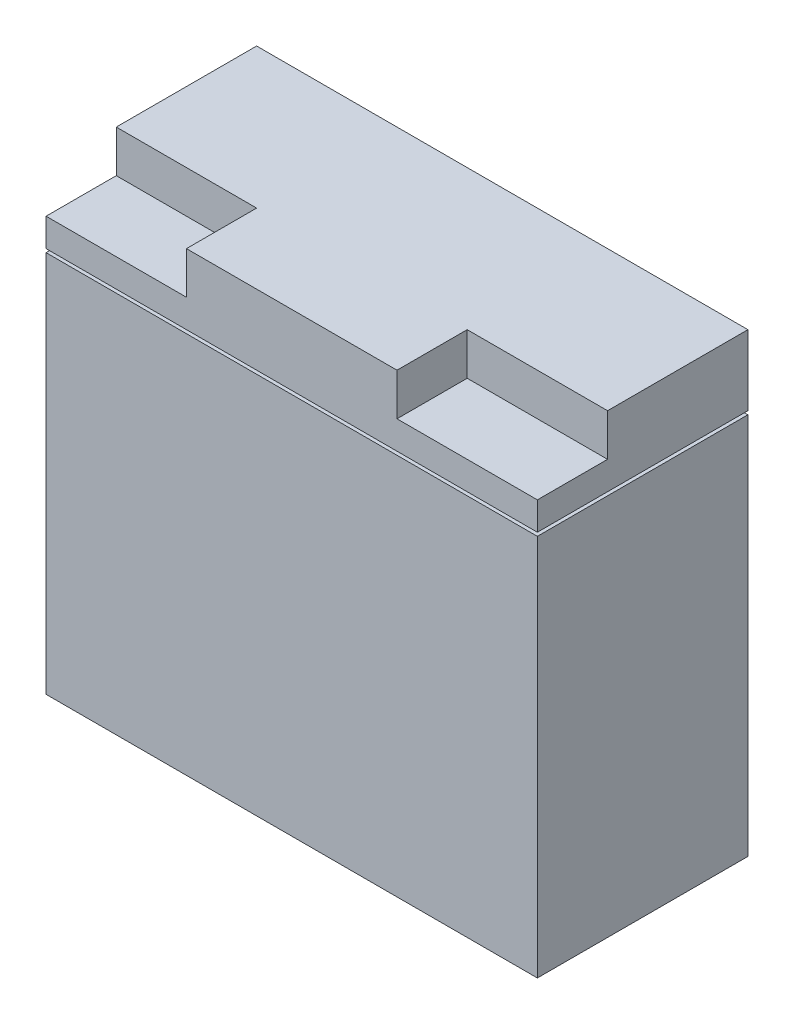
ISO-10303-21;
HEADER;
FILE_DESCRIPTION(('STEP AP214'),'2;1');
FILE_NAME('part.step','',(''),(''),'','','');
FILE_SCHEMA(('AUTOMOTIVE_DESIGN { 1 0 10303 214 1 1 1 1 }'));
ENDSEC;
DATA;
#1=APPLICATION_CONTEXT('core data for automotive mechanical design processes');
#2=APPLICATION_PROTOCOL_DEFINITION('international standard','automotive_design',2000,#1);
#3=PRODUCT_CONTEXT('',#1,'mechanical');
#4=PRODUCT('Part','Part','',(#3));
#5=PRODUCT_RELATED_PRODUCT_CATEGORY('part','',(#4));
#6=PRODUCT_DEFINITION_FORMATION('','',#4);
#7=PRODUCT_DEFINITION_CONTEXT('part definition',#1,'design');
#8=PRODUCT_DEFINITION('design','',#6,#7);
#9=PRODUCT_DEFINITION_SHAPE('','',#8);
#10=(LENGTH_UNIT() NAMED_UNIT(*) SI_UNIT(.MILLI.,.METRE.));
#11=(NAMED_UNIT(*) PLANE_ANGLE_UNIT() SI_UNIT($,.RADIAN.));
#12=(NAMED_UNIT(*) SI_UNIT($,.STERADIAN.) SOLID_ANGLE_UNIT());
#13=UNCERTAINTY_MEASURE_WITH_UNIT(LENGTH_MEASURE(1.E-05),#10,'distance_accuracy_value','');
#14=(GEOMETRIC_REPRESENTATION_CONTEXT(3) GLOBAL_UNCERTAINTY_ASSIGNED_CONTEXT((#13)) GLOBAL_UNIT_ASSIGNED_CONTEXT((#10,
#11,#12)) REPRESENTATION_CONTEXT('',''));
#15=CARTESIAN_POINT('',(0.,0.,0.));
#16=DIRECTION('',(0.,0.,1.));
#17=DIRECTION('',(1.,0.,0.));
#18=AXIS2_PLACEMENT_3D('',#15,#16,#17);
#19=CARTESIAN_POINT('',(0.,165.1,0.));
#20=DIRECTION('',(1.,0.,0.));
#21=DIRECTION('',(0.,0.,-1.));
#22=AXIS2_PLACEMENT_3D('',#19,#20,#21);
#23=PLANE('',#22);
#24=DIRECTION('',(0.,-1.,0.));
#25=VECTOR('',#24,1.);
#26=CARTESIAN_POINT('',(0.,165.1,-76.2));
#27=LINE('',#26,#25);
#28=CARTESIAN_POINT('',(0.,165.1,-76.2));
#29=VERTEX_POINT('',#28);
#30=CARTESIAN_POINT('',(0.,139.7,-76.2));
#31=VERTEX_POINT('',#30);
#32=EDGE_CURVE('E321',#29,#31,#27,.T.);
#33=ORIENTED_EDGE('',*,*,#32,.T.);
#34=DIRECTION('',(0.,0.,1.));
#35=VECTOR('',#34,1.);
#36=CARTESIAN_POINT('',(0.,139.7,-76.2));
#37=LINE('',#36,#35);
#38=CARTESIAN_POINT('',(0.,139.7,0.));
#39=VERTEX_POINT('',#38);
#40=EDGE_CURVE('E62',#31,#39,#37,.T.);
#41=ORIENTED_EDGE('',*,*,#40,.T.);
#42=DIRECTION('',(0.,-1.,0.));
#43=VECTOR('',#42,1.);
#44=CARTESIAN_POINT('',(0.,165.1,0.));
#45=LINE('',#44,#43);
#46=CARTESIAN_POINT('',(0.,149.86,0.));
#47=VERTEX_POINT('',#46);
#48=EDGE_CURVE('E11',#47,#39,#45,.T.);
#49=ORIENTED_EDGE('',*,*,#48,.F.);
#50=DIRECTION('',(0.,0.,1.));
#51=VECTOR('',#50,1.);
#52=CARTESIAN_POINT('',(0.,149.86,0.));
#53=LINE('',#52,#51);
#54=CARTESIAN_POINT('',(0.,149.86,-25.4));
#55=VERTEX_POINT('',#54);
#56=EDGE_CURVE('E268',#55,#47,#53,.T.);
#57=ORIENTED_EDGE('',*,*,#56,.F.);
#58=DIRECTION('',(0.,1.,0.));
#59=VECTOR('',#58,1.);
#60=CARTESIAN_POINT('',(0.,149.86,-25.4));
#61=LINE('',#60,#59);
#62=CARTESIAN_POINT('',(0.,165.1,-25.4));
#63=VERTEX_POINT('',#62);
#64=EDGE_CURVE('E287',#55,#63,#61,.T.);
#65=ORIENTED_EDGE('',*,*,#64,.T.);
#66=DIRECTION('',(0.,0.,1.));
#67=VECTOR('',#66,1.);
#68=CARTESIAN_POINT('',(0.,165.1,0.));
#69=LINE('',#68,#67);
#70=EDGE_CURVE('E296',#29,#63,#69,.T.);
#71=ORIENTED_EDGE('',*,*,#70,.F.);
#72=EDGE_LOOP('',(#33,#41,#49,#57,#65,#71));
#73=FACE_BOUND('',#72,.T.);
#74=ADVANCED_FACE('F40',(#73),#23,.F.);
#75=CARTESIAN_POINT('',(0.,165.1,0.));
#76=DIRECTION('',(0.,0.,-1.));
#77=DIRECTION('',(-1.,0.,0.));
#78=AXIS2_PLACEMENT_3D('',#75,#76,#77);
#79=PLANE('',#78);
#80=ORIENTED_EDGE('',*,*,#48,.T.);
#81=DIRECTION('',(1.,0.,0.));
#82=VECTOR('',#81,1.);
#83=CARTESIAN_POINT('',(0.,139.7,0.));
#84=LINE('',#83,#82);
#85=CARTESIAN_POINT('',(177.8,139.7,0.));
#86=VERTEX_POINT('',#85);
#87=EDGE_CURVE('E213',#39,#86,#84,.T.);
#88=ORIENTED_EDGE('',*,*,#87,.T.);
#89=DIRECTION('',(0.,-1.,0.));
#90=VECTOR('',#89,1.);
#91=CARTESIAN_POINT('',(177.8,165.1,0.));
#92=LINE('',#91,#90);
#93=CARTESIAN_POINT('',(177.8,149.86,0.));
#94=VERTEX_POINT('',#93);
#95=EDGE_CURVE('E328',#94,#86,#92,.T.);
#96=ORIENTED_EDGE('',*,*,#95,.F.);
#97=DIRECTION('',(1.,0.,0.));
#98=VECTOR('',#97,1.);
#99=CARTESIAN_POINT('',(177.8,149.86,0.));
#100=LINE('',#99,#98);
#101=CARTESIAN_POINT('',(127.,149.86,0.));
#102=VERTEX_POINT('',#101);
#103=EDGE_CURVE('E237',#102,#94,#100,.T.);
#104=ORIENTED_EDGE('',*,*,#103,.F.);
#105=DIRECTION('',(0.,1.,0.));
#106=VECTOR('',#105,1.);
#107=CARTESIAN_POINT('',(127.,149.86,0.));
#108=LINE('',#107,#106);
#109=CARTESIAN_POINT('',(127.,165.1,0.));
#110=VERTEX_POINT('',#109);
#111=EDGE_CURVE('E259',#102,#110,#108,.T.);
#112=ORIENTED_EDGE('',*,*,#111,.T.);
#113=DIRECTION('',(1.,0.,0.));
#114=VECTOR('',#113,1.);
#115=CARTESIAN_POINT('',(0.,165.1,0.));
#116=LINE('',#115,#114);
#117=CARTESIAN_POINT('',(50.8,165.1,0.));
#118=VERTEX_POINT('',#117);
#119=EDGE_CURVE('E299',#118,#110,#116,.T.);
#120=ORIENTED_EDGE('',*,*,#119,.F.);
#121=DIRECTION('',(0.,1.,0.));
#122=VECTOR('',#121,1.);
#123=CARTESIAN_POINT('',(50.8,149.86,0.));
#124=LINE('',#123,#122);
#125=CARTESIAN_POINT('',(50.8,149.86,0.));
#126=VERTEX_POINT('',#125);
#127=EDGE_CURVE('E283',#126,#118,#124,.T.);
#128=ORIENTED_EDGE('',*,*,#127,.F.);
#129=DIRECTION('',(1.,0.,0.));
#130=VECTOR('',#129,1.);
#131=CARTESIAN_POINT('',(0.,149.86,0.));
#132=LINE('',#131,#130);
#133=EDGE_CURVE('E270',#47,#126,#132,.T.);
#134=ORIENTED_EDGE('',*,*,#133,.F.);
#135=EDGE_LOOP('',(#80,#88,#96,#104,#112,#120,#128,#134));
#136=FACE_BOUND('',#135,.T.);
#137=ADVANCED_FACE('F358',(#136),#79,.F.);
#138=CARTESIAN_POINT('',(177.8,165.1,0.));
#139=DIRECTION('',(-1.,0.,0.));
#140=DIRECTION('',(0.,0.,1.));
#141=AXIS2_PLACEMENT_3D('',#138,#139,#140);
#142=PLANE('',#141);
#143=ORIENTED_EDGE('',*,*,#95,.T.);
#144=DIRECTION('',(0.,0.,-1.));
#145=VECTOR('',#144,1.);
#146=CARTESIAN_POINT('',(177.8,139.7,0.));
#147=LINE('',#146,#145);
#148=CARTESIAN_POINT('',(177.8,139.7,-76.2));
#149=VERTEX_POINT('',#148);
#150=EDGE_CURVE('E230',#86,#149,#147,.T.);
#151=ORIENTED_EDGE('',*,*,#150,.T.);
#152=DIRECTION('',(0.,-1.,0.));
#153=VECTOR('',#152,1.);
#154=CARTESIAN_POINT('',(177.8,165.1,-76.2));
#155=LINE('',#154,#153);
#156=CARTESIAN_POINT('',(177.8,165.1,-76.2));
#157=VERTEX_POINT('',#156);
#158=EDGE_CURVE('E325',#157,#149,#155,.T.);
#159=ORIENTED_EDGE('',*,*,#158,.F.);
#160=DIRECTION('',(0.,0.,-1.));
#161=VECTOR('',#160,1.);
#162=CARTESIAN_POINT('',(177.8,165.1,0.));
#163=LINE('',#162,#161);
#164=CARTESIAN_POINT('',(177.8,165.1,-25.4));
#165=VERTEX_POINT('',#164);
#166=EDGE_CURVE('E304',#165,#157,#163,.T.);
#167=ORIENTED_EDGE('',*,*,#166,.F.);
#168=DIRECTION('',(0.,1.,0.));
#169=VECTOR('',#168,1.);
#170=CARTESIAN_POINT('',(177.8,149.86,-25.4));
#171=LINE('',#170,#169);
#172=CARTESIAN_POINT('',(177.8,149.86,-25.4));
#173=VERTEX_POINT('',#172);
#174=EDGE_CURVE('E253',#173,#165,#171,.T.);
#175=ORIENTED_EDGE('',*,*,#174,.F.);
#176=DIRECTION('',(0.,0.,-1.));
#177=VECTOR('',#176,1.);
#178=CARTESIAN_POINT('',(177.8,149.86,0.));
#179=LINE('',#178,#177);
#180=EDGE_CURVE('E240',#94,#173,#179,.T.);
#181=ORIENTED_EDGE('',*,*,#180,.F.);
#182=EDGE_LOOP('',(#143,#151,#159,#167,#175,#181));
#183=FACE_BOUND('',#182,.T.);
#184=ADVANCED_FACE('F364',(#183),#142,.F.);
#185=CARTESIAN_POINT('',(0.,165.1,-76.2));
#186=DIRECTION('',(0.,0.,1.));
#187=DIRECTION('',(1.,0.,0.));
#188=AXIS2_PLACEMENT_3D('',#185,#186,#187);
#189=PLANE('',#188);
#190=ORIENTED_EDGE('',*,*,#158,.T.);
#191=DIRECTION('',(-1.,0.,0.));
#192=VECTOR('',#191,1.);
#193=CARTESIAN_POINT('',(177.8,139.7,-76.2));
#194=LINE('',#193,#192);
#195=EDGE_CURVE('E234',#149,#31,#194,.T.);
#196=ORIENTED_EDGE('',*,*,#195,.T.);
#197=ORIENTED_EDGE('',*,*,#32,.F.);
#198=DIRECTION('',(-1.,0.,0.));
#199=VECTOR('',#198,1.);
#200=CARTESIAN_POINT('',(0.,165.1,-76.2));
#201=LINE('',#200,#199);
#202=EDGE_CURVE('E307',#157,#29,#201,.T.);
#203=ORIENTED_EDGE('',*,*,#202,.F.);
#204=EDGE_LOOP('',(#190,#196,#197,#203));
#205=FACE_BOUND('',#204,.T.);
#206=ADVANCED_FACE('F371',(#205),#189,.F.);
#207=CARTESIAN_POINT('',(0.,165.1,0.));
#208=DIRECTION('',(0.,-1.,0.));
#209=DIRECTION('',(0.,0.,-1.));
#210=AXIS2_PLACEMENT_3D('',#207,#208,#209);
#211=PLANE('',#210);
#212=ORIENTED_EDGE('',*,*,#119,.T.);
#213=DIRECTION('',(0.,0.,1.));
#214=VECTOR('',#213,1.);
#215=CARTESIAN_POINT('',(127.,165.1,0.));
#216=LINE('',#215,#214);
#217=CARTESIAN_POINT('',(127.,165.1,-25.4));
#218=VERTEX_POINT('',#217);
#219=EDGE_CURVE('E241',#218,#110,#216,.T.);
#220=ORIENTED_EDGE('',*,*,#219,.F.);
#221=DIRECTION('',(-1.,0.,0.));
#222=VECTOR('',#221,1.);
#223=CARTESIAN_POINT('',(177.8,165.1,-25.4));
#224=LINE('',#223,#222);
#225=EDGE_CURVE('E226',#165,#218,#224,.T.);
#226=ORIENTED_EDGE('',*,*,#225,.F.);
#227=ORIENTED_EDGE('',*,*,#166,.T.);
#228=ORIENTED_EDGE('',*,*,#202,.T.);
#229=ORIENTED_EDGE('',*,*,#70,.T.);
#230=DIRECTION('',(-1.,0.,0.));
#231=VECTOR('',#230,1.);
#232=CARTESIAN_POINT('',(0.,165.1,-25.4));
#233=LINE('',#232,#231);
#234=CARTESIAN_POINT('',(50.8,165.1,-25.4));
#235=VERTEX_POINT('',#234);
#236=EDGE_CURVE('E271',#235,#63,#233,.T.);
#237=ORIENTED_EDGE('',*,*,#236,.F.);
#238=DIRECTION('',(0.,0.,-1.));
#239=VECTOR('',#238,1.);
#240=CARTESIAN_POINT('',(50.8,165.1,0.));
#241=LINE('',#240,#239);
#242=EDGE_CURVE('E263',#118,#235,#241,.T.);
#243=ORIENTED_EDGE('',*,*,#242,.F.);
#244=EDGE_LOOP('',(#212,#220,#226,#227,#228,#229,#237,#243));
#245=FACE_BOUND('',#244,.T.);
#246=ADVANCED_FACE('F378',(#245),#211,.F.);
#247=CARTESIAN_POINT('',(0.,149.86,-25.4));
#248=DIRECTION('',(0.,0.,-1.));
#249=DIRECTION('',(-1.,0.,0.));
#250=AXIS2_PLACEMENT_3D('',#247,#248,#249);
#251=PLANE('',#250);
#252=ORIENTED_EDGE('',*,*,#236,.T.);
#253=ORIENTED_EDGE('',*,*,#64,.F.);
#254=DIRECTION('',(-1.,0.,0.));
#255=VECTOR('',#254,1.);
#256=CARTESIAN_POINT('',(0.,149.86,-25.4));
#257=LINE('',#256,#255);
#258=CARTESIAN_POINT('',(50.8,149.86,-25.4));
#259=VERTEX_POINT('',#258);
#260=EDGE_CURVE('E279',#259,#55,#257,.T.);
#261=ORIENTED_EDGE('',*,*,#260,.F.);
#262=DIRECTION('',(0.,1.,0.));
#263=VECTOR('',#262,1.);
#264=CARTESIAN_POINT('',(50.8,149.86,-25.4));
#265=LINE('',#264,#263);
#266=EDGE_CURVE('E291',#259,#235,#265,.T.);
#267=ORIENTED_EDGE('',*,*,#266,.T.);
#268=EDGE_LOOP('',(#252,#253,#261,#267));
#269=FACE_BOUND('',#268,.T.);
#270=ADVANCED_FACE('F393',(#269),#251,.F.);
#271=CARTESIAN_POINT('',(50.8,149.86,0.));
#272=DIRECTION('',(1.,0.,0.));
#273=DIRECTION('',(0.,0.,-1.));
#274=AXIS2_PLACEMENT_3D('',#271,#272,#273);
#275=PLANE('',#274);
#276=ORIENTED_EDGE('',*,*,#242,.T.);
#277=ORIENTED_EDGE('',*,*,#266,.F.);
#278=DIRECTION('',(0.,0.,-1.));
#279=VECTOR('',#278,1.);
#280=CARTESIAN_POINT('',(50.8,149.86,0.));
#281=LINE('',#280,#279);
#282=EDGE_CURVE('E275',#126,#259,#281,.T.);
#283=ORIENTED_EDGE('',*,*,#282,.F.);
#284=ORIENTED_EDGE('',*,*,#127,.T.);
#285=EDGE_LOOP('',(#276,#277,#283,#284));
#286=FACE_BOUND('',#285,.T.);
#287=ADVANCED_FACE('F407',(#286),#275,.F.);
#288=CARTESIAN_POINT('',(0.,149.86,0.));
#289=DIRECTION('',(0.,-1.,0.));
#290=DIRECTION('',(0.,0.,-1.));
#291=AXIS2_PLACEMENT_3D('',#288,#289,#290);
#292=PLANE('',#291);
#293=ORIENTED_EDGE('',*,*,#56,.T.);
#294=ORIENTED_EDGE('',*,*,#133,.T.);
#295=ORIENTED_EDGE('',*,*,#282,.T.);
#296=ORIENTED_EDGE('',*,*,#260,.T.);
#297=EDGE_LOOP('',(#293,#294,#295,#296));
#298=FACE_BOUND('',#297,.T.);
#299=ADVANCED_FACE('F390',(#298),#292,.F.);
#300=CARTESIAN_POINT('',(127.,149.86,0.));
#301=DIRECTION('',(-1.,0.,0.));
#302=DIRECTION('',(0.,0.,1.));
#303=AXIS2_PLACEMENT_3D('',#300,#301,#302);
#304=PLANE('',#303);
#305=ORIENTED_EDGE('',*,*,#219,.T.);
#306=ORIENTED_EDGE('',*,*,#111,.F.);
#307=DIRECTION('',(0.,0.,1.));
#308=VECTOR('',#307,1.);
#309=CARTESIAN_POINT('',(127.,149.86,0.));
#310=LINE('',#309,#308);
#311=CARTESIAN_POINT('',(127.,149.86,-25.4));
#312=VERTEX_POINT('',#311);
#313=EDGE_CURVE('E249',#312,#102,#310,.T.);
#314=ORIENTED_EDGE('',*,*,#313,.F.);
#315=DIRECTION('',(0.,1.,0.));
#316=VECTOR('',#315,1.);
#317=CARTESIAN_POINT('',(127.,149.86,-25.4));
#318=LINE('',#317,#316);
#319=EDGE_CURVE('E264',#312,#218,#318,.T.);
#320=ORIENTED_EDGE('',*,*,#319,.T.);
#321=EDGE_LOOP('',(#305,#306,#314,#320));
#322=FACE_BOUND('',#321,.T.);
#323=ADVANCED_FACE('F399',(#322),#304,.F.);
#324=CARTESIAN_POINT('',(177.8,149.86,-25.4));
#325=DIRECTION('',(0.,0.,-1.));
#326=DIRECTION('',(-1.,0.,0.));
#327=AXIS2_PLACEMENT_3D('',#324,#325,#326);
#328=PLANE('',#327);
#329=ORIENTED_EDGE('',*,*,#225,.T.);
#330=ORIENTED_EDGE('',*,*,#319,.F.);
#331=DIRECTION('',(-1.,0.,0.));
#332=VECTOR('',#331,1.);
#333=CARTESIAN_POINT('',(177.8,149.86,-25.4));
#334=LINE('',#333,#332);
#335=EDGE_CURVE('E245',#173,#312,#334,.T.);
#336=ORIENTED_EDGE('',*,*,#335,.F.);
#337=ORIENTED_EDGE('',*,*,#174,.T.);
#338=EDGE_LOOP('',(#329,#330,#336,#337));
#339=FACE_BOUND('',#338,.T.);
#340=ADVANCED_FACE('F381',(#339),#328,.F.);
#341=CARTESIAN_POINT('',(0.,149.86,0.));
#342=DIRECTION('',(0.,-1.,0.));
#343=DIRECTION('',(0.,0.,-1.));
#344=AXIS2_PLACEMENT_3D('',#341,#342,#343);
#345=PLANE('',#344);
#346=ORIENTED_EDGE('',*,*,#103,.T.);
#347=ORIENTED_EDGE('',*,*,#180,.T.);
#348=ORIENTED_EDGE('',*,*,#335,.T.);
#349=ORIENTED_EDGE('',*,*,#313,.T.);
#350=EDGE_LOOP('',(#346,#347,#348,#349));
#351=FACE_BOUND('',#350,.T.);
#352=ADVANCED_FACE('F384',(#351),#345,.F.);
#353=CARTESIAN_POINT('',(0.,138.43,0.));
#354=DIRECTION('',(0.,1.,0.));
#355=DIRECTION('',(0.,0.,1.));
#356=AXIS2_PLACEMENT_3D('',#353,#354,#355);
#357=PLANE('',#356);
#358=DIRECTION('',(0.,0.,-1.));
#359=VECTOR('',#358,1.);
#360=CARTESIAN_POINT('',(176.53,138.43,-1.27000000000001));
#361=LINE('',#360,#359);
#362=CARTESIAN_POINT('',(176.53,138.43,-1.27000000000001));
#363=VERTEX_POINT('',#362);
#364=CARTESIAN_POINT('',(176.53,138.43,-74.93));
#365=VERTEX_POINT('',#364);
#366=EDGE_CURVE('E181',#363,#365,#361,.T.);
#367=ORIENTED_EDGE('',*,*,#366,.F.);
#368=DIRECTION('',(1.,0.,0.));
#369=VECTOR('',#368,1.);
#370=CARTESIAN_POINT('',(1.27000000000001,138.43,-1.27));
#371=LINE('',#370,#369);
#372=CARTESIAN_POINT('',(1.27000000000001,138.43,-1.27));
#373=VERTEX_POINT('',#372);
#374=EDGE_CURVE('E190',#373,#363,#371,.T.);
#375=ORIENTED_EDGE('',*,*,#374,.F.);
#376=DIRECTION('',(0.,0.,1.));
#377=VECTOR('',#376,1.);
#378=CARTESIAN_POINT('',(1.27,138.43,-74.93));
#379=LINE('',#378,#377);
#380=CARTESIAN_POINT('',(1.27,138.43,-74.93));
#381=VERTEX_POINT('',#380);
#382=EDGE_CURVE('E174',#381,#373,#379,.T.);
#383=ORIENTED_EDGE('',*,*,#382,.F.);
#384=DIRECTION('',(-1.,0.,0.));
#385=VECTOR('',#384,1.);
#386=CARTESIAN_POINT('',(176.53,138.43,-74.93));
#387=LINE('',#386,#385);
#388=EDGE_CURVE('E187',#365,#381,#387,.T.);
#389=ORIENTED_EDGE('',*,*,#388,.F.);
#390=EDGE_LOOP('',(#367,#375,#383,#389));
#391=FACE_BOUND('',#390,.T.);
#392=DIRECTION('',(1.,0.,0.));
#393=VECTOR('',#392,1.);
#394=CARTESIAN_POINT('',(0.,138.43,0.));
#395=LINE('',#394,#393);
#396=CARTESIAN_POINT('',(0.,138.43,0.));
#397=VERTEX_POINT('',#396);
#398=CARTESIAN_POINT('',(177.8,138.43,0.));
#399=VERTEX_POINT('',#398);
#400=EDGE_CURVE('E217',#397,#399,#395,.T.);
#401=ORIENTED_EDGE('',*,*,#400,.T.);
#402=DIRECTION('',(0.,0.,-1.));
#403=VECTOR('',#402,1.);
#404=CARTESIAN_POINT('',(177.8,138.43,0.));
#405=LINE('',#404,#403);
#406=CARTESIAN_POINT('',(177.8,138.43,-76.2));
#407=VERTEX_POINT('',#406);
#408=EDGE_CURVE('E54',#399,#407,#405,.T.);
#409=ORIENTED_EDGE('',*,*,#408,.T.);
#410=DIRECTION('',(-1.,0.,0.));
#411=VECTOR('',#410,1.);
#412=CARTESIAN_POINT('',(177.8,138.43,-76.2));
#413=LINE('',#412,#411);
#414=CARTESIAN_POINT('',(0.,138.43,-76.2));
#415=VERTEX_POINT('',#414);
#416=EDGE_CURVE('E222',#407,#415,#413,.T.);
#417=ORIENTED_EDGE('',*,*,#416,.T.);
#418=DIRECTION('',(0.,0.,1.));
#419=VECTOR('',#418,1.);
#420=CARTESIAN_POINT('',(0.,138.43,-76.2));
#421=LINE('',#420,#419);
#422=EDGE_CURVE('E224',#415,#397,#421,.T.);
#423=ORIENTED_EDGE('',*,*,#422,.T.);
#424=EDGE_LOOP('',(#401,#409,#417,#423));
#425=FACE_BOUND('',#424,.T.);
#426=ADVANCED_FACE('F186',(#391,#425),#357,.T.);
#427=CARTESIAN_POINT('',(0.,139.7,0.));
#428=DIRECTION('',(0.,1.,0.));
#429=DIRECTION('',(0.,0.,1.));
#430=AXIS2_PLACEMENT_3D('',#427,#428,#429);
#431=PLANE('',#430);
#432=DIRECTION('',(-1.,0.,0.));
#433=VECTOR('',#432,1.);
#434=CARTESIAN_POINT('',(176.53,139.7,-74.93));
#435=LINE('',#434,#433);
#436=CARTESIAN_POINT('',(176.53,139.7,-74.93));
#437=VERTEX_POINT('',#436);
#438=CARTESIAN_POINT('',(1.27,139.7,-74.93));
#439=VERTEX_POINT('',#438);
#440=EDGE_CURVE('E206',#437,#439,#435,.T.);
#441=ORIENTED_EDGE('',*,*,#440,.T.);
#442=DIRECTION('',(0.,0.,1.));
#443=VECTOR('',#442,1.);
#444=CARTESIAN_POINT('',(1.27,139.7,-74.93));
#445=LINE('',#444,#443);
#446=CARTESIAN_POINT('',(1.27000000000001,139.7,-1.27));
#447=VERTEX_POINT('',#446);
#448=EDGE_CURVE('E176',#439,#447,#445,.T.);
#449=ORIENTED_EDGE('',*,*,#448,.T.);
#450=DIRECTION('',(1.,0.,0.));
#451=VECTOR('',#450,1.);
#452=CARTESIAN_POINT('',(1.27000000000001,139.7,-1.27));
#453=LINE('',#452,#451);
#454=CARTESIAN_POINT('',(176.53,139.7,-1.27000000000001));
#455=VERTEX_POINT('',#454);
#456=EDGE_CURVE('E199',#447,#455,#453,.T.);
#457=ORIENTED_EDGE('',*,*,#456,.T.);
#458=DIRECTION('',(0.,0.,-1.));
#459=VECTOR('',#458,1.);
#460=CARTESIAN_POINT('',(176.53,139.7,-1.27000000000001));
#461=LINE('',#460,#459);
#462=EDGE_CURVE('E195',#455,#437,#461,.T.);
#463=ORIENTED_EDGE('',*,*,#462,.T.);
#464=EDGE_LOOP('',(#441,#449,#457,#463));
#465=FACE_BOUND('',#464,.T.);
#466=ORIENTED_EDGE('',*,*,#87,.F.);
#467=ORIENTED_EDGE('',*,*,#40,.F.);
#468=ORIENTED_EDGE('',*,*,#195,.F.);
#469=ORIENTED_EDGE('',*,*,#150,.F.);
#470=EDGE_LOOP('',(#466,#467,#468,#469));
#471=FACE_BOUND('',#470,.T.);
#472=ADVANCED_FACE('F373',(#465,#471),#431,.F.);
#473=CARTESIAN_POINT('',(176.53,138.43,-74.93));
#474=DIRECTION('',(0.,0.,-1.));
#475=DIRECTION('',(-1.,0.,0.));
#476=AXIS2_PLACEMENT_3D('',#473,#474,#475);
#477=PLANE('',#476);
#478=ORIENTED_EDGE('',*,*,#440,.F.);
#479=DIRECTION('',(0.,1.,0.));
#480=VECTOR('',#479,1.);
#481=CARTESIAN_POINT('',(176.53,138.43,-74.93));
#482=LINE('',#481,#480);
#483=EDGE_CURVE('E194',#365,#437,#482,.T.);
#484=ORIENTED_EDGE('',*,*,#483,.F.);
#485=ORIENTED_EDGE('',*,*,#388,.T.);
#486=DIRECTION('',(0.,1.,0.));
#487=VECTOR('',#486,1.);
#488=CARTESIAN_POINT('',(1.27,138.43,-74.93));
#489=LINE('',#488,#487);
#490=EDGE_CURVE('E171',#381,#439,#489,.T.);
#491=ORIENTED_EDGE('',*,*,#490,.T.);
#492=EDGE_LOOP('',(#478,#484,#485,#491));
#493=FACE_BOUND('',#492,.T.);
#494=ADVANCED_FACE('F193',(#493),#477,.T.);
#495=CARTESIAN_POINT('',(176.53,138.43,-1.27000000000001));
#496=DIRECTION('',(1.,0.,0.));
#497=DIRECTION('',(0.,0.,-1.));
#498=AXIS2_PLACEMENT_3D('',#495,#496,#497);
#499=PLANE('',#498);
#500=ORIENTED_EDGE('',*,*,#462,.F.);
#501=DIRECTION('',(0.,1.,0.));
#502=VECTOR('',#501,1.);
#503=CARTESIAN_POINT('',(176.53,138.43,-1.27000000000001));
#504=LINE('',#503,#502);
#505=EDGE_CURVE('E214',#363,#455,#504,.T.);
#506=ORIENTED_EDGE('',*,*,#505,.F.);
#507=ORIENTED_EDGE('',*,*,#366,.T.);
#508=ORIENTED_EDGE('',*,*,#483,.T.);
#509=EDGE_LOOP('',(#500,#506,#507,#508));
#510=FACE_BOUND('',#509,.T.);
#511=ADVANCED_FACE('F448',(#510),#499,.T.);
#512=CARTESIAN_POINT('',(1.27000000000001,138.43,-1.27));
#513=DIRECTION('',(0.,0.,1.));
#514=DIRECTION('',(1.,0.,0.));
#515=AXIS2_PLACEMENT_3D('',#512,#513,#514);
#516=PLANE('',#515);
#517=ORIENTED_EDGE('',*,*,#456,.F.);
#518=DIRECTION('',(0.,1.,0.));
#519=VECTOR('',#518,1.);
#520=CARTESIAN_POINT('',(1.27000000000001,138.43,-1.27));
#521=LINE('',#520,#519);
#522=EDGE_CURVE('E180',#373,#447,#521,.T.);
#523=ORIENTED_EDGE('',*,*,#522,.F.);
#524=ORIENTED_EDGE('',*,*,#374,.T.);
#525=ORIENTED_EDGE('',*,*,#505,.T.);
#526=EDGE_LOOP('',(#517,#523,#524,#525));
#527=FACE_BOUND('',#526,.T.);
#528=ADVANCED_FACE('F441',(#527),#516,.T.);
#529=CARTESIAN_POINT('',(1.27,138.43,-74.93));
#530=DIRECTION('',(-1.,0.,0.));
#531=DIRECTION('',(0.,0.,1.));
#532=AXIS2_PLACEMENT_3D('',#529,#530,#531);
#533=PLANE('',#532);
#534=ORIENTED_EDGE('',*,*,#448,.F.);
#535=ORIENTED_EDGE('',*,*,#490,.F.);
#536=ORIENTED_EDGE('',*,*,#382,.T.);
#537=ORIENTED_EDGE('',*,*,#522,.T.);
#538=EDGE_LOOP('',(#534,#535,#536,#537));
#539=FACE_BOUND('',#538,.T.);
#540=ADVANCED_FACE('F173',(#539),#533,.T.);
#541=CARTESIAN_POINT('',(0.,0.,0.));
#542=DIRECTION('',(0.,-1.,0.));
#543=DIRECTION('',(0.,0.,-1.));
#544=AXIS2_PLACEMENT_3D('',#541,#542,#543);
#545=PLANE('',#544);
#546=DIRECTION('',(0.,0.,1.));
#547=VECTOR('',#546,1.);
#548=CARTESIAN_POINT('',(0.,0.,0.));
#549=LINE('',#548,#547);
#550=CARTESIAN_POINT('',(0.,0.,-76.2));
#551=VERTEX_POINT('',#550);
#552=CARTESIAN_POINT('',(0.,0.,0.));
#553=VERTEX_POINT('',#552);
#554=EDGE_CURVE('E290',#551,#553,#549,.T.);
#555=ORIENTED_EDGE('',*,*,#554,.F.);
#556=DIRECTION('',(-1.,0.,0.));
#557=VECTOR('',#556,1.);
#558=CARTESIAN_POINT('',(0.,0.,-76.2));
#559=LINE('',#558,#557);
#560=CARTESIAN_POINT('',(177.8,0.,-76.2));
#561=VERTEX_POINT('',#560);
#562=EDGE_CURVE('E300',#561,#551,#559,.T.);
#563=ORIENTED_EDGE('',*,*,#562,.F.);
#564=DIRECTION('',(0.,0.,-1.));
#565=VECTOR('',#564,1.);
#566=CARTESIAN_POINT('',(177.8,0.,0.));
#567=LINE('',#566,#565);
#568=CARTESIAN_POINT('',(177.8,0.,0.));
#569=VERTEX_POINT('',#568);
#570=EDGE_CURVE('E316',#569,#561,#567,.T.);
#571=ORIENTED_EDGE('',*,*,#570,.F.);
#572=DIRECTION('',(1.,0.,0.));
#573=VECTOR('',#572,1.);
#574=CARTESIAN_POINT('',(0.,0.,0.));
#575=LINE('',#574,#573);
#576=EDGE_CURVE('E312',#553,#569,#575,.T.);
#577=ORIENTED_EDGE('',*,*,#576,.F.);
#578=EDGE_LOOP('',(#555,#563,#571,#577));
#579=FACE_BOUND('',#578,.T.);
#580=ADVANCED_FACE('F346',(#579),#545,.T.);
#581=ORIENTED_EDGE('',*,*,#416,.F.);
#582=EDGE_CURVE('E324',#407,#561,#155,.T.);
#583=ORIENTED_EDGE('',*,*,#582,.T.);
#584=ORIENTED_EDGE('',*,*,#562,.T.);
#585=EDGE_CURVE('E309',#415,#551,#27,.T.);
#586=ORIENTED_EDGE('',*,*,#585,.F.);
#587=EDGE_LOOP('',(#581,#583,#584,#586));
#588=FACE_BOUND('',#587,.T.);
#589=ADVANCED_FACE('F349',(#588),#189,.F.);
#590=ORIENTED_EDGE('',*,*,#408,.F.);
#591=EDGE_CURVE('E327',#399,#569,#92,.T.);
#592=ORIENTED_EDGE('',*,*,#591,.T.);
#593=ORIENTED_EDGE('',*,*,#570,.T.);
#594=ORIENTED_EDGE('',*,*,#582,.F.);
#595=EDGE_LOOP('',(#590,#592,#593,#594));
#596=FACE_BOUND('',#595,.T.);
#597=ADVANCED_FACE('F335',(#596),#142,.F.);
#598=ORIENTED_EDGE('',*,*,#400,.F.);
#599=EDGE_CURVE('E47',#397,#553,#45,.T.);
#600=ORIENTED_EDGE('',*,*,#599,.T.);
#601=ORIENTED_EDGE('',*,*,#576,.T.);
#602=ORIENTED_EDGE('',*,*,#591,.F.);
#603=EDGE_LOOP('',(#598,#600,#601,#602));
#604=FACE_BOUND('',#603,.T.);
#605=ADVANCED_FACE('F342',(#604),#79,.F.);
#606=ORIENTED_EDGE('',*,*,#422,.F.);
#607=ORIENTED_EDGE('',*,*,#585,.T.);
#608=ORIENTED_EDGE('',*,*,#554,.T.);
#609=ORIENTED_EDGE('',*,*,#599,.F.);
#610=EDGE_LOOP('',(#606,#607,#608,#609));
#611=FACE_BOUND('',#610,.T.);
#612=ADVANCED_FACE('F352',(#611),#23,.F.);
#613=CLOSED_SHELL('',(#74,#137,#184,#206,#246,#270,#287,#299,#323,#340,#352,#426,#472,#494,#511,
#528,#540,#580,#589,#597,#605,#612));
#614=MANIFOLD_SOLID_BREP('B2',#613);
#615=ADVANCED_BREP_SHAPE_REPRESENTATION('',(#18,#614),#14);
#616=SHAPE_DEFINITION_REPRESENTATION(#9,#615);
ENDSEC;
END-ISO-10303-21;
